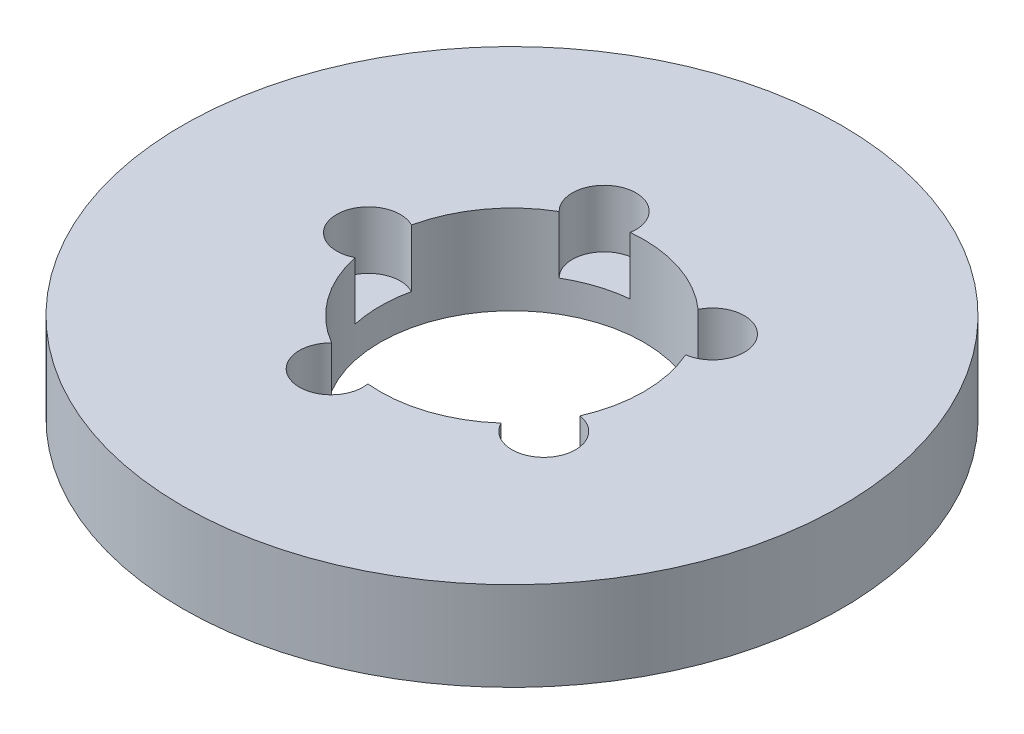
ISO-10303-21;
HEADER;
FILE_DESCRIPTION(('STEP AP214'),'2;1');
FILE_NAME('part.step','',(''),(''),'','','');
FILE_SCHEMA(('AUTOMOTIVE_DESIGN { 1 0 10303 214 1 1 1 1 }'));
ENDSEC;
DATA;
#1=APPLICATION_CONTEXT('core data for automotive mechanical design processes');
#2=APPLICATION_PROTOCOL_DEFINITION('international standard','automotive_design',2000,#1);
#3=PRODUCT_CONTEXT('',#1,'mechanical');
#4=PRODUCT('Part','Part','',(#3));
#5=PRODUCT_RELATED_PRODUCT_CATEGORY('part','',(#4));
#6=PRODUCT_DEFINITION_FORMATION('','',#4);
#7=PRODUCT_DEFINITION_CONTEXT('part definition',#1,'design');
#8=PRODUCT_DEFINITION('design','',#6,#7);
#9=PRODUCT_DEFINITION_SHAPE('','',#8);
#10=(LENGTH_UNIT() NAMED_UNIT(*) SI_UNIT(.MILLI.,.METRE.));
#11=(NAMED_UNIT(*) PLANE_ANGLE_UNIT() SI_UNIT($,.RADIAN.));
#12=(NAMED_UNIT(*) SI_UNIT($,.STERADIAN.) SOLID_ANGLE_UNIT());
#13=UNCERTAINTY_MEASURE_WITH_UNIT(LENGTH_MEASURE(1.E-05),#10,'distance_accuracy_value','');
#14=(GEOMETRIC_REPRESENTATION_CONTEXT(3) GLOBAL_UNCERTAINTY_ASSIGNED_CONTEXT((#13)) GLOBAL_UNIT_ASSIGNED_CONTEXT((#10,
#11,#12)) REPRESENTATION_CONTEXT('',''));
#15=CARTESIAN_POINT('',(0.,0.,0.));
#16=DIRECTION('',(0.,0.,1.));
#17=DIRECTION('',(1.,0.,0.));
#18=AXIS2_PLACEMENT_3D('',#15,#16,#17);
#19=CARTESIAN_POINT('',(0.,27.,0.));
#20=DIRECTION('',(0.,-1.,0.));
#21=DIRECTION('',(0.,0.,-1.));
#22=AXIS2_PLACEMENT_3D('',#19,#20,#21);
#23=CYLINDRICAL_SURFACE('',#22,100.);
#24=CARTESIAN_POINT('',(0.,27.,0.));
#25=DIRECTION('',(0.,1.,0.));
#26=DIRECTION('',(0.,0.,1.));
#27=AXIS2_PLACEMENT_3D('',#24,#25,#26);
#28=CIRCLE('',#27,100.);
#29=CARTESIAN_POINT('',(0.,27.,100.));
#30=VERTEX_POINT('',#29);
#31=EDGE_CURVE('E157',#30,#30,#28,.T.);
#32=ORIENTED_EDGE('',*,*,#31,.F.);
#33=EDGE_LOOP('',(#32));
#34=FACE_BOUND('',#33,.T.);
#35=CARTESIAN_POINT('',(0.,0.,0.));
#36=DIRECTION('',(0.,1.,0.));
#37=DIRECTION('',(0.,0.,1.));
#38=AXIS2_PLACEMENT_3D('',#35,#36,#37);
#39=CIRCLE('',#38,100.);
#40=CARTESIAN_POINT('',(0.,0.,100.));
#41=VERTEX_POINT('',#40);
#42=EDGE_CURVE('E150',#41,#41,#39,.T.);
#43=ORIENTED_EDGE('',*,*,#42,.T.);
#44=EDGE_LOOP('',(#43));
#45=FACE_BOUND('',#44,.T.);
#46=ADVANCED_FACE('F39',(#34,#45),#23,.T.);
#47=CARTESIAN_POINT('',(0.,27.,0.));
#48=DIRECTION('',(0.,1.,0.));
#49=DIRECTION('',(0.,0.,1.));
#50=AXIS2_PLACEMENT_3D('',#47,#48,#49);
#51=PLANE('',#50);
#52=CARTESIAN_POINT('',(-13.4565812028566,27.,-41.4150984346922));
#53=DIRECTION('',(0.,1.,0.));
#54=DIRECTION('',(-0.95105651629515,0.,0.309016994374958));
#55=AXIS2_PLACEMENT_3D('',#52,#53,#54);
#56=CIRCLE('',#55,9.65913122514605);
#57=CARTESIAN_POINT('',(-3.9323817274032,27.,-39.8062353652036));
#58=VERTEX_POINT('',#57);
#59=CARTESIAN_POINT('',(-20.2161544511118,27.,-34.5153168782903));
#60=VERTEX_POINT('',#59);
#61=EDGE_CURVE('E194',#58,#60,#56,.T.);
#62=ORIENTED_EDGE('',*,*,#61,.F.);
#63=CARTESIAN_POINT('',(0.,27.,0.));
#64=DIRECTION('',(0.,1.,0.));
#65=DIRECTION('',(0.,0.,1.));
#66=AXIS2_PLACEMENT_3D('',#63,#64,#65);
#67=CIRCLE('',#66,40.);
#68=CARTESIAN_POINT('',(26.5788817427879,27.,-29.8925249067873));
#69=VERTEX_POINT('',#68);
#70=EDGE_CURVE('E147',#69,#58,#67,.T.);
#71=ORIENTED_EDGE('',*,*,#70,.F.);
#72=CARTESIAN_POINT('',(35.2297869614501,27.,-25.5959384800627));
#73=DIRECTION('',(0.,1.,0.));
#74=DIRECTION('',(-0.58778525229248,0.,-0.809016994374942));
#75=AXIS2_PLACEMENT_3D('',#72,#73,#74);
#76=CIRCLE('',#75,9.65913122514605);
#77=CARTESIAN_POINT('',(36.6428067511184,27.,-16.0407204763437));
#78=VERTEX_POINT('',#77);
#79=EDGE_CURVE('E254',#78,#69,#76,.T.);
#80=ORIENTED_EDGE('',*,*,#79,.F.);
#81=CARTESIAN_POINT('',(36.6428067511186,27.,16.0407204763431));
#82=VERTEX_POINT('',#81);
#83=EDGE_CURVE('E144',#82,#78,#67,.T.);
#84=ORIENTED_EDGE('',*,*,#83,.F.);
#85=CARTESIAN_POINT('',(35.2297869614505,27.,25.5959384800622));
#86=DIRECTION('',(0.,1.,0.));
#87=DIRECTION('',(0.587785252292469,0.,-0.809016994374951));
#88=AXIS2_PLACEMENT_3D('',#85,#86,#87);
#89=CIRCLE('',#88,9.65913122514605);
#90=CARTESIAN_POINT('',(26.5788817427883,27.,29.8925249067869));
#91=VERTEX_POINT('',#90);
#92=EDGE_CURVE('E141',#91,#82,#89,.T.);
#93=ORIENTED_EDGE('',*,*,#92,.F.);
#94=CARTESIAN_POINT('',(-3.93238172740264,27.,39.8062353652037));
#95=VERTEX_POINT('',#94);
#96=EDGE_CURVE('E134',#95,#91,#67,.T.);
#97=ORIENTED_EDGE('',*,*,#96,.F.);
#98=CARTESIAN_POINT('',(-13.456581202856,27.,41.4150984346924));
#99=DIRECTION('',(0.,1.,0.));
#100=DIRECTION('',(0.951056516295155,0.,0.309016994374945));
#101=AXIS2_PLACEMENT_3D('',#98,#99,#100);
#102=CIRCLE('',#101,9.65913122514605);
#103=CARTESIAN_POINT('',(-20.2161544511114,27.,34.5153168782906));
#104=VERTEX_POINT('',#103);
#105=EDGE_CURVE('E111',#104,#95,#102,.T.);
#106=ORIENTED_EDGE('',*,*,#105,.F.);
#107=CARTESIAN_POINT('',(-39.0731523153925,27.,8.56088594353059));
#108=VERTEX_POINT('',#107);
#109=EDGE_CURVE('E145',#108,#104,#67,.T.);
#110=ORIENTED_EDGE('',*,*,#109,.F.);
#111=CARTESIAN_POINT('',(-43.5464115171884,27.,0.));
#112=DIRECTION('',(0.,1.,0.));
#113=DIRECTION('',(0.,0.,1.));
#114=AXIS2_PLACEMENT_3D('',#111,#112,#113);
#115=CIRCLE('',#114,9.65913122514605);
#116=CARTESIAN_POINT('',(-39.0731523153925,27.,-8.56088594353059));
#117=VERTEX_POINT('',#116);
#118=EDGE_CURVE('E153',#117,#108,#115,.T.);
#119=ORIENTED_EDGE('',*,*,#118,.F.);
#120=EDGE_CURVE('E146',#60,#117,#67,.T.);
#121=ORIENTED_EDGE('',*,*,#120,.F.);
#122=EDGE_LOOP('',(#62,#71,#80,#84,#93,#97,#106,#110,#119,#121));
#123=FACE_BOUND('',#122,.T.);
#124=ORIENTED_EDGE('',*,*,#31,.T.);
#125=EDGE_LOOP('',(#124));
#126=FACE_BOUND('',#125,.T.);
#127=ADVANCED_FACE('F139',(#123,#126),#51,.T.);
#128=CARTESIAN_POINT('',(0.,0.,0.));
#129=DIRECTION('',(0.,1.,0.));
#130=DIRECTION('',(0.,0.,1.));
#131=AXIS2_PLACEMENT_3D('',#128,#129,#130);
#132=PLANE('',#131);
#133=CARTESIAN_POINT('',(0.,0.,0.));
#134=DIRECTION('',(0.,1.,0.));
#135=DIRECTION('',(0.,0.,1.));
#136=AXIS2_PLACEMENT_3D('',#133,#134,#135);
#137=CIRCLE('',#136,40.);
#138=CARTESIAN_POINT('',(0.,0.,40.));
#139=VERTEX_POINT('',#138);
#140=EDGE_CURVE('E154',#139,#139,#137,.T.);
#141=ORIENTED_EDGE('',*,*,#140,.T.);
#142=EDGE_LOOP('',(#141));
#143=FACE_BOUND('',#142,.T.);
#144=ORIENTED_EDGE('',*,*,#42,.F.);
#145=EDGE_LOOP('',(#144));
#146=FACE_BOUND('',#145,.T.);
#147=ADVANCED_FACE('F213',(#143,#146),#132,.F.);
#148=CARTESIAN_POINT('',(0.,27.,0.));
#149=DIRECTION('',(0.,-1.,0.));
#150=DIRECTION('',(0.,0.,-1.));
#151=AXIS2_PLACEMENT_3D('',#148,#149,#150);
#152=CYLINDRICAL_SURFACE('',#151,40.);
#153=DIRECTION('',(0.,1.,0.));
#154=VECTOR('',#153,1.);
#155=CARTESIAN_POINT('',(-3.9323817274032,18.2519717679823,-39.8062353652036));
#156=LINE('',#155,#154);
#157=CARTESIAN_POINT('',(-3.9323817274032,9.5039435359646,-39.8062353652036));
#158=VERTEX_POINT('',#157);
#159=EDGE_CURVE('E11',#158,#58,#156,.T.);
#160=ORIENTED_EDGE('',*,*,#159,.F.);
#161=CARTESIAN_POINT('',(0.,9.5039435359646,0.));
#162=DIRECTION('',(0.,1.,0.));
#163=DIRECTION('',(0.,0.,1.));
#164=AXIS2_PLACEMENT_3D('',#161,#162,#163);
#165=CIRCLE('',#164,40.);
#166=CARTESIAN_POINT('',(-20.2161544511118,9.5039435359646,-34.5153168782903));
#167=VERTEX_POINT('',#166);
#168=EDGE_CURVE('E189',#158,#167,#165,.T.);
#169=ORIENTED_EDGE('',*,*,#168,.T.);
#170=DIRECTION('',(0.,1.,0.));
#171=VECTOR('',#170,1.);
#172=CARTESIAN_POINT('',(-20.2161544511118,18.2519717679823,-34.5153168782903));
#173=LINE('',#172,#171);
#174=EDGE_CURVE('E46',#60,#167,#173,.F.);
#175=ORIENTED_EDGE('',*,*,#174,.F.);
#176=ORIENTED_EDGE('',*,*,#120,.T.);
#177=DIRECTION('',(0.,1.,0.));
#178=VECTOR('',#177,1.);
#179=CARTESIAN_POINT('',(-39.0731523153925,18.2519717679823,-8.56088594353059));
#180=LINE('',#179,#178);
#181=CARTESIAN_POINT('',(-39.0731523153925,9.5039435359646,-8.56088594353059));
#182=VERTEX_POINT('',#181);
#183=EDGE_CURVE('E168',#182,#117,#180,.T.);
#184=ORIENTED_EDGE('',*,*,#183,.F.);
#185=CARTESIAN_POINT('',(0.,9.5039435359646,0.));
#186=DIRECTION('',(0.,1.,0.));
#187=DIRECTION('',(0.,0.,1.));
#188=AXIS2_PLACEMENT_3D('',#185,#186,#187);
#189=CIRCLE('',#188,40.);
#190=CARTESIAN_POINT('',(-39.0731523153925,9.5039435359646,8.56088594353059));
#191=VERTEX_POINT('',#190);
#192=EDGE_CURVE('E165',#182,#191,#189,.T.);
#193=ORIENTED_EDGE('',*,*,#192,.T.);
#194=DIRECTION('',(0.,1.,0.));
#195=VECTOR('',#194,1.);
#196=CARTESIAN_POINT('',(-39.0731523153925,18.2519717679823,8.56088594353059));
#197=LINE('',#196,#195);
#198=EDGE_CURVE('E170',#108,#191,#197,.F.);
#199=ORIENTED_EDGE('',*,*,#198,.F.);
#200=ORIENTED_EDGE('',*,*,#109,.T.);
#201=DIRECTION('',(0.,1.,0.));
#202=VECTOR('',#201,1.);
#203=CARTESIAN_POINT('',(-20.2161544511114,18.2519717679823,34.5153168782906));
#204=LINE('',#203,#202);
#205=CARTESIAN_POINT('',(-20.2161544511114,9.5039435359646,34.5153168782906));
#206=VERTEX_POINT('',#205);
#207=EDGE_CURVE('E121',#206,#104,#204,.T.);
#208=ORIENTED_EDGE('',*,*,#207,.F.);
#209=CARTESIAN_POINT('',(0.,9.5039435359646,0.));
#210=DIRECTION('',(0.,1.,0.));
#211=DIRECTION('',(0.,0.,1.));
#212=AXIS2_PLACEMENT_3D('',#209,#210,#211);
#213=CIRCLE('',#212,40.);
#214=CARTESIAN_POINT('',(-3.93238172740264,9.5039435359646,39.8062353652037));
#215=VERTEX_POINT('',#214);
#216=EDGE_CURVE('E136',#206,#215,#213,.T.);
#217=ORIENTED_EDGE('',*,*,#216,.T.);
#218=DIRECTION('',(0.,1.,0.));
#219=VECTOR('',#218,1.);
#220=CARTESIAN_POINT('',(-3.93238172740264,18.2519717679823,39.8062353652037));
#221=LINE('',#220,#219);
#222=EDGE_CURVE('E117',#95,#215,#221,.F.);
#223=ORIENTED_EDGE('',*,*,#222,.F.);
#224=ORIENTED_EDGE('',*,*,#96,.T.);
#225=DIRECTION('',(0.,1.,0.));
#226=VECTOR('',#225,1.);
#227=CARTESIAN_POINT('',(26.5788817427883,18.2519717679823,29.8925249067869));
#228=LINE('',#227,#226);
#229=CARTESIAN_POINT('',(26.5788817427883,9.5039435359646,29.8925249067869));
#230=VERTEX_POINT('',#229);
#231=EDGE_CURVE('E182',#230,#91,#228,.T.);
#232=ORIENTED_EDGE('',*,*,#231,.F.);
#233=CARTESIAN_POINT('',(0.,9.5039435359646,0.));
#234=DIRECTION('',(0.,1.,0.));
#235=DIRECTION('',(0.,0.,1.));
#236=AXIS2_PLACEMENT_3D('',#233,#234,#235);
#237=CIRCLE('',#236,40.);
#238=CARTESIAN_POINT('',(36.6428067511186,9.5039435359646,16.0407204763431));
#239=VERTEX_POINT('',#238);
#240=EDGE_CURVE('E174',#230,#239,#237,.T.);
#241=ORIENTED_EDGE('',*,*,#240,.T.);
#242=DIRECTION('',(0.,1.,0.));
#243=VECTOR('',#242,1.);
#244=CARTESIAN_POINT('',(36.6428067511186,18.2519717679823,16.0407204763431));
#245=LINE('',#244,#243);
#246=EDGE_CURVE('E177',#82,#239,#245,.F.);
#247=ORIENTED_EDGE('',*,*,#246,.F.);
#248=ORIENTED_EDGE('',*,*,#83,.T.);
#249=DIRECTION('',(0.,1.,0.));
#250=VECTOR('',#249,1.);
#251=CARTESIAN_POINT('',(36.6428067511184,18.2519717679823,-16.0407204763437));
#252=LINE('',#251,#250);
#253=CARTESIAN_POINT('',(36.6428067511184,9.5039435359646,-16.0407204763437));
#254=VERTEX_POINT('',#253);
#255=EDGE_CURVE('E187',#254,#78,#252,.T.);
#256=ORIENTED_EDGE('',*,*,#255,.F.);
#257=CARTESIAN_POINT('',(0.,9.5039435359646,0.));
#258=DIRECTION('',(0.,1.,0.));
#259=DIRECTION('',(0.,0.,1.));
#260=AXIS2_PLACEMENT_3D('',#257,#258,#259);
#261=CIRCLE('',#260,40.);
#262=CARTESIAN_POINT('',(26.5788817427879,9.5039435359646,-29.8925249067873));
#263=VERTEX_POINT('',#262);
#264=EDGE_CURVE('E181',#254,#263,#261,.T.);
#265=ORIENTED_EDGE('',*,*,#264,.T.);
#266=DIRECTION('',(0.,1.,0.));
#267=VECTOR('',#266,1.);
#268=CARTESIAN_POINT('',(26.5788817427879,18.2519717679823,-29.8925249067873));
#269=LINE('',#268,#267);
#270=EDGE_CURVE('E186',#69,#263,#269,.F.);
#271=ORIENTED_EDGE('',*,*,#270,.F.);
#272=ORIENTED_EDGE('',*,*,#70,.T.);
#273=EDGE_LOOP('',(#160,#169,#175,#176,#184,#193,#199,#200,#208,#217,#223,#224,#232,#241,#247,
#248,#256,#265,#271,#272));
#274=FACE_BOUND('',#273,.T.);
#275=ORIENTED_EDGE('',*,*,#140,.F.);
#276=EDGE_LOOP('',(#275));
#277=FACE_BOUND('',#276,.T.);
#278=ADVANCED_FACE('F135',(#274,#277),#152,.F.);
#279=CARTESIAN_POINT('',(-43.5464115171884,9.5039435359646,0.));
#280=DIRECTION('',(0.,1.,0.));
#281=DIRECTION('',(0.,0.,1.));
#282=AXIS2_PLACEMENT_3D('',#279,#280,#281);
#283=CYLINDRICAL_SURFACE('',#282,9.65913122514605);
#284=ORIENTED_EDGE('',*,*,#183,.T.);
#285=ORIENTED_EDGE('',*,*,#118,.T.);
#286=ORIENTED_EDGE('',*,*,#198,.T.);
#287=CARTESIAN_POINT('',(-43.5464115171884,9.5039435359646,0.));
#288=DIRECTION('',(0.,1.,0.));
#289=DIRECTION('',(0.,0.,1.));
#290=AXIS2_PLACEMENT_3D('',#287,#288,#289);
#291=CIRCLE('',#290,9.65913122514605);
#292=EDGE_CURVE('E158',#182,#191,#291,.T.);
#293=ORIENTED_EDGE('',*,*,#292,.F.);
#294=EDGE_LOOP('',(#284,#285,#286,#293));
#295=FACE_BOUND('',#294,.T.);
#296=ADVANCED_FACE('F221',(#295),#283,.F.);
#297=CARTESIAN_POINT('',(-43.5464115171884,9.5039435359646,0.));
#298=DIRECTION('',(0.,1.,0.));
#299=DIRECTION('',(0.,0.,1.));
#300=AXIS2_PLACEMENT_3D('',#297,#298,#299);
#301=PLANE('',#300);
#302=ORIENTED_EDGE('',*,*,#292,.T.);
#303=ORIENTED_EDGE('',*,*,#192,.F.);
#304=EDGE_LOOP('',(#302,#303));
#305=FACE_BOUND('',#304,.T.);
#306=ADVANCED_FACE('F227',(#305),#301,.T.);
#307=CARTESIAN_POINT('',(-13.456581202856,9.5039435359646,41.4150984346924));
#308=DIRECTION('',(0.,1.,0.));
#309=DIRECTION('',(0.,0.,1.));
#310=AXIS2_PLACEMENT_3D('',#307,#308,#309);
#311=CYLINDRICAL_SURFACE('',#310,9.65913122514605);
#312=ORIENTED_EDGE('',*,*,#207,.T.);
#313=ORIENTED_EDGE('',*,*,#105,.T.);
#314=ORIENTED_EDGE('',*,*,#222,.T.);
#315=CARTESIAN_POINT('',(-13.456581202856,9.5039435359646,41.4150984346924));
#316=DIRECTION('',(0.,1.,0.));
#317=DIRECTION('',(0.951056516295155,0.,0.309016994374945));
#318=AXIS2_PLACEMENT_3D('',#315,#316,#317);
#319=CIRCLE('',#318,9.65913122514605);
#320=EDGE_CURVE('E127',#206,#215,#319,.T.);
#321=ORIENTED_EDGE('',*,*,#320,.F.);
#322=EDGE_LOOP('',(#312,#313,#314,#321));
#323=FACE_BOUND('',#322,.T.);
#324=ADVANCED_FACE('F116',(#323),#311,.F.);
#325=CARTESIAN_POINT('',(-13.456581202856,9.5039435359646,41.4150984346924));
#326=DIRECTION('',(0.,1.,0.));
#327=DIRECTION('',(0.951056516295155,0.,0.309016994374945));
#328=AXIS2_PLACEMENT_3D('',#325,#326,#327);
#329=PLANE('',#328);
#330=ORIENTED_EDGE('',*,*,#320,.T.);
#331=ORIENTED_EDGE('',*,*,#216,.F.);
#332=EDGE_LOOP('',(#330,#331));
#333=FACE_BOUND('',#332,.T.);
#334=ADVANCED_FACE('F234',(#333),#329,.T.);
#335=CARTESIAN_POINT('',(35.2297869614505,9.5039435359646,25.5959384800622));
#336=DIRECTION('',(0.,1.,0.));
#337=DIRECTION('',(0.,0.,1.));
#338=AXIS2_PLACEMENT_3D('',#335,#336,#337);
#339=CYLINDRICAL_SURFACE('',#338,9.65913122514605);
#340=ORIENTED_EDGE('',*,*,#231,.T.);
#341=ORIENTED_EDGE('',*,*,#92,.T.);
#342=ORIENTED_EDGE('',*,*,#246,.T.);
#343=CARTESIAN_POINT('',(35.2297869614505,9.5039435359646,25.5959384800622));
#344=DIRECTION('',(0.,1.,0.));
#345=DIRECTION('',(0.587785252292469,0.,-0.809016994374951));
#346=AXIS2_PLACEMENT_3D('',#343,#344,#345);
#347=CIRCLE('',#346,9.65913122514605);
#348=EDGE_CURVE('E130',#230,#239,#347,.T.);
#349=ORIENTED_EDGE('',*,*,#348,.F.);
#350=EDGE_LOOP('',(#340,#341,#342,#349));
#351=FACE_BOUND('',#350,.T.);
#352=ADVANCED_FACE('F240',(#351),#339,.F.);
#353=CARTESIAN_POINT('',(35.2297869614505,9.5039435359646,25.5959384800622));
#354=DIRECTION('',(0.,1.,0.));
#355=DIRECTION('',(0.587785252292469,0.,-0.809016994374951));
#356=AXIS2_PLACEMENT_3D('',#353,#354,#355);
#357=PLANE('',#356);
#358=ORIENTED_EDGE('',*,*,#348,.T.);
#359=ORIENTED_EDGE('',*,*,#240,.F.);
#360=EDGE_LOOP('',(#358,#359));
#361=FACE_BOUND('',#360,.T.);
#362=ADVANCED_FACE('F245',(#361),#357,.T.);
#363=CARTESIAN_POINT('',(35.2297869614501,9.5039435359646,-25.5959384800627));
#364=DIRECTION('',(0.,1.,0.));
#365=DIRECTION('',(0.,0.,1.));
#366=AXIS2_PLACEMENT_3D('',#363,#364,#365);
#367=CYLINDRICAL_SURFACE('',#366,9.65913122514605);
#368=ORIENTED_EDGE('',*,*,#255,.T.);
#369=ORIENTED_EDGE('',*,*,#79,.T.);
#370=ORIENTED_EDGE('',*,*,#270,.T.);
#371=CARTESIAN_POINT('',(35.2297869614501,9.5039435359646,-25.5959384800627));
#372=DIRECTION('',(0.,1.,0.));
#373=DIRECTION('',(-0.58778525229248,0.,-0.809016994374942));
#374=AXIS2_PLACEMENT_3D('',#371,#372,#373);
#375=CIRCLE('',#374,9.65913122514605);
#376=EDGE_CURVE('E56',#254,#263,#375,.T.);
#377=ORIENTED_EDGE('',*,*,#376,.F.);
#378=EDGE_LOOP('',(#368,#369,#370,#377));
#379=FACE_BOUND('',#378,.T.);
#380=ADVANCED_FACE('F266',(#379),#367,.F.);
#381=CARTESIAN_POINT('',(35.2297869614501,9.5039435359646,-25.5959384800627));
#382=DIRECTION('',(0.,1.,0.));
#383=DIRECTION('',(-0.58778525229248,0.,-0.809016994374942));
#384=AXIS2_PLACEMENT_3D('',#381,#382,#383);
#385=PLANE('',#384);
#386=ORIENTED_EDGE('',*,*,#376,.T.);
#387=ORIENTED_EDGE('',*,*,#264,.F.);
#388=EDGE_LOOP('',(#386,#387));
#389=FACE_BOUND('',#388,.T.);
#390=ADVANCED_FACE('F204',(#389),#385,.T.);
#391=CARTESIAN_POINT('',(-13.4565812028566,9.5039435359646,-41.4150984346922));
#392=DIRECTION('',(0.,1.,0.));
#393=DIRECTION('',(0.,0.,1.));
#394=AXIS2_PLACEMENT_3D('',#391,#392,#393);
#395=CYLINDRICAL_SURFACE('',#394,9.65913122514605);
#396=ORIENTED_EDGE('',*,*,#159,.T.);
#397=ORIENTED_EDGE('',*,*,#61,.T.);
#398=ORIENTED_EDGE('',*,*,#174,.T.);
#399=CARTESIAN_POINT('',(-13.4565812028566,9.5039435359646,-41.4150984346922));
#400=DIRECTION('',(0.,1.,0.));
#401=DIRECTION('',(-0.95105651629515,0.,0.309016994374958));
#402=AXIS2_PLACEMENT_3D('',#399,#400,#401);
#403=CIRCLE('',#402,9.65913122514605);
#404=EDGE_CURVE('E55',#158,#167,#403,.T.);
#405=ORIENTED_EDGE('',*,*,#404,.F.);
#406=EDGE_LOOP('',(#396,#397,#398,#405));
#407=FACE_BOUND('',#406,.T.);
#408=ADVANCED_FACE('F193',(#407),#395,.F.);
#409=CARTESIAN_POINT('',(-13.4565812028566,9.5039435359646,-41.4150984346922));
#410=DIRECTION('',(0.,1.,0.));
#411=DIRECTION('',(-0.95105651629515,0.,0.309016994374958));
#412=AXIS2_PLACEMENT_3D('',#409,#410,#411);
#413=PLANE('',#412);
#414=ORIENTED_EDGE('',*,*,#404,.T.);
#415=ORIENTED_EDGE('',*,*,#168,.F.);
#416=EDGE_LOOP('',(#414,#415));
#417=FACE_BOUND('',#416,.T.);
#418=ADVANCED_FACE('F196',(#417),#413,.T.);
#419=CLOSED_SHELL('',(#46,#127,#147,#278,#296,#306,#324,#334,#352,#362,#380,#390,#408,#418));
#420=MANIFOLD_SOLID_BREP('B2',#419);
#421=ADVANCED_BREP_SHAPE_REPRESENTATION('',(#18,#420),#14);
#422=SHAPE_DEFINITION_REPRESENTATION(#9,#421);
ENDSEC;
END-ISO-10303-21;
